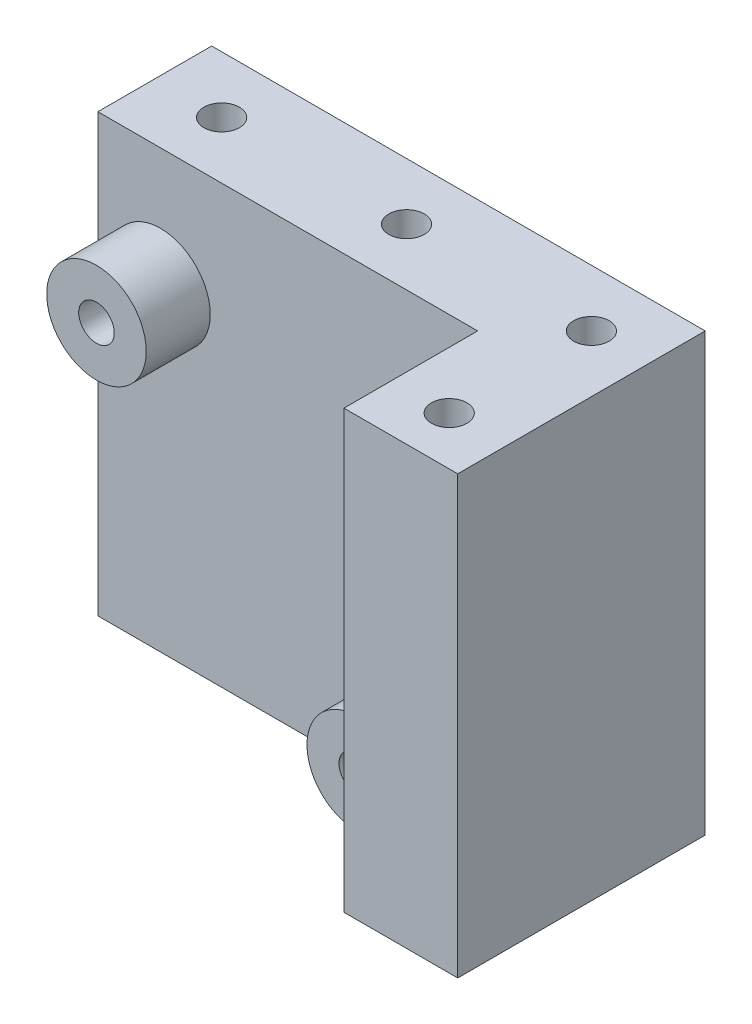
ISO-10303-21;
HEADER;
FILE_DESCRIPTION(('STEP AP214'),'2;1');
FILE_NAME('part.step','',(''),(''),'','','');
FILE_SCHEMA(('AUTOMOTIVE_DESIGN { 1 0 10303 214 1 1 1 1 }'));
ENDSEC;
DATA;
#1=APPLICATION_CONTEXT('core data for automotive mechanical design processes');
#2=APPLICATION_PROTOCOL_DEFINITION('international standard','automotive_design',2000,#1);
#3=PRODUCT_CONTEXT('',#1,'mechanical');
#4=PRODUCT('Part','Part','',(#3));
#5=PRODUCT_RELATED_PRODUCT_CATEGORY('part','',(#4));
#6=PRODUCT_DEFINITION_FORMATION('','',#4);
#7=PRODUCT_DEFINITION_CONTEXT('part definition',#1,'design');
#8=PRODUCT_DEFINITION('design','',#6,#7);
#9=PRODUCT_DEFINITION_SHAPE('','',#8);
#10=(LENGTH_UNIT() NAMED_UNIT(*) SI_UNIT(.MILLI.,.METRE.));
#11=(NAMED_UNIT(*) PLANE_ANGLE_UNIT() SI_UNIT($,.RADIAN.));
#12=(NAMED_UNIT(*) SI_UNIT($,.STERADIAN.) SOLID_ANGLE_UNIT());
#13=UNCERTAINTY_MEASURE_WITH_UNIT(LENGTH_MEASURE(1.E-05),#10,'distance_accuracy_value','');
#14=(GEOMETRIC_REPRESENTATION_CONTEXT(3) GLOBAL_UNCERTAINTY_ASSIGNED_CONTEXT((#13)) GLOBAL_UNIT_ASSIGNED_CONTEXT((#10,
#11,#12)) REPRESENTATION_CONTEXT('',''));
#15=CARTESIAN_POINT('',(0.,0.,0.));
#16=DIRECTION('',(0.,0.,1.));
#17=DIRECTION('',(1.,0.,0.));
#18=AXIS2_PLACEMENT_3D('',#15,#16,#17);
#19=CARTESIAN_POINT('',(0.,0.,8.));
#20=DIRECTION('',(0.,0.,1.));
#21=DIRECTION('',(1.,0.,0.));
#22=AXIS2_PLACEMENT_3D('',#19,#20,#21);
#23=PLANE('',#22);
#24=CARTESIAN_POINT('',(-12.,-11.35,8.));
#25=DIRECTION('',(0.,0.,1.));
#26=DIRECTION('',(1.,0.,0.));
#27=AXIS2_PLACEMENT_3D('',#24,#25,#26);
#28=CIRCLE('',#27,3.5);
#29=CARTESIAN_POINT('',(-8.5,-11.35,8.));
#30=VERTEX_POINT('',#29);
#31=EDGE_CURVE('E111',#30,#30,#28,.F.);
#32=ORIENTED_EDGE('',*,*,#31,.T.);
#33=EDGE_LOOP('',(#32));
#34=FACE_BOUND('',#33,.T.);
#35=CARTESIAN_POINT('',(-30.3,6.95,8.));
#36=DIRECTION('',(0.,0.,1.));
#37=DIRECTION('',(1.,0.,0.));
#38=AXIS2_PLACEMENT_3D('',#35,#36,#37);
#39=CIRCLE('',#38,3.5);
#40=CARTESIAN_POINT('',(-26.8,6.95,8.));
#41=VERTEX_POINT('',#40);
#42=EDGE_CURVE('E99',#41,#41,#39,.F.);
#43=ORIENTED_EDGE('',*,*,#42,.T.);
#44=EDGE_LOOP('',(#43));
#45=FACE_BOUND('',#44,.T.);
#46=DIRECTION('',(1.,0.,0.));
#47=VECTOR('',#46,1.);
#48=CARTESIAN_POINT('',(-34.7,-15.35,8.));
#49=LINE('',#48,#47);
#50=CARTESIAN_POINT('',(-34.7,-15.35,8.));
#51=VERTEX_POINT('',#50);
#52=CARTESIAN_POINT('',(-8.,-15.35,8.));
#53=VERTEX_POINT('',#52);
#54=EDGE_CURVE('E53',#51,#53,#49,.T.);
#55=ORIENTED_EDGE('',*,*,#54,.T.);
#56=DIRECTION('',(0.,-1.,0.));
#57=VECTOR('',#56,1.);
#58=CARTESIAN_POINT('',(-8.,15.35,8.));
#59=LINE('',#58,#57);
#60=CARTESIAN_POINT('',(-8.,15.35,8.));
#61=VERTEX_POINT('',#60);
#62=EDGE_CURVE('E145',#61,#53,#59,.T.);
#63=ORIENTED_EDGE('',*,*,#62,.F.);
#64=DIRECTION('',(-1.,0.,0.));
#65=VECTOR('',#64,1.);
#66=CARTESIAN_POINT('',(-34.7,15.35,8.));
#67=LINE('',#66,#65);
#68=CARTESIAN_POINT('',(-34.7,15.35,8.));
#69=VERTEX_POINT('',#68);
#70=EDGE_CURVE('E59',#61,#69,#67,.T.);
#71=ORIENTED_EDGE('',*,*,#70,.T.);
#72=DIRECTION('',(0.,-1.,0.));
#73=VECTOR('',#72,1.);
#74=CARTESIAN_POINT('',(-34.7,15.35,8.));
#75=LINE('',#74,#73);
#76=EDGE_CURVE('E89',#69,#51,#75,.T.);
#77=ORIENTED_EDGE('',*,*,#76,.T.);
#78=EDGE_LOOP('',(#55,#63,#71,#77));
#79=FACE_BOUND('',#78,.T.);
#80=ADVANCED_FACE('F32',(#34,#45,#79),#23,.T.);
#81=CARTESIAN_POINT('',(-34.7,15.35,8.));
#82=DIRECTION('',(1.,0.,0.));
#83=DIRECTION('',(0.,0.,-1.));
#84=AXIS2_PLACEMENT_3D('',#81,#82,#83);
#85=PLANE('',#84);
#86=DIRECTION('',(0.,-1.,0.));
#87=VECTOR('',#86,1.);
#88=CARTESIAN_POINT('',(-34.7,15.35,0.));
#89=LINE('',#88,#87);
#90=CARTESIAN_POINT('',(-34.7,15.35,0.));
#91=VERTEX_POINT('',#90);
#92=CARTESIAN_POINT('',(-34.7,-15.35,0.));
#93=VERTEX_POINT('',#92);
#94=EDGE_CURVE('E95',#91,#93,#89,.T.);
#95=ORIENTED_EDGE('',*,*,#94,.T.);
#96=DIRECTION('',(0.,0.,-1.));
#97=VECTOR('',#96,1.);
#98=CARTESIAN_POINT('',(-34.7,-15.35,8.));
#99=LINE('',#98,#97);
#100=EDGE_CURVE('E11',#51,#93,#99,.T.);
#101=ORIENTED_EDGE('',*,*,#100,.F.);
#102=ORIENTED_EDGE('',*,*,#76,.F.);
#103=DIRECTION('',(0.,0.,-1.));
#104=VECTOR('',#103,1.);
#105=CARTESIAN_POINT('',(-34.7,15.35,8.));
#106=LINE('',#105,#104);
#107=EDGE_CURVE('E81',#69,#91,#106,.T.);
#108=ORIENTED_EDGE('',*,*,#107,.T.);
#109=EDGE_LOOP('',(#95,#101,#102,#108));
#110=FACE_BOUND('',#109,.T.);
#111=ADVANCED_FACE('F34',(#110),#85,.F.);
#112=CARTESIAN_POINT('',(-34.7,-15.35,8.));
#113=DIRECTION('',(0.,1.,0.));
#114=DIRECTION('',(0.,0.,1.));
#115=AXIS2_PLACEMENT_3D('',#112,#113,#114);
#116=PLANE('',#115);
#117=CARTESIAN_POINT('',(-30.,-15.35,4.));
#118=DIRECTION('',(0.,1.,0.));
#119=DIRECTION('',(0.,0.,1.));
#120=AXIS2_PLACEMENT_3D('',#117,#118,#119);
#121=CIRCLE('',#120,1.25);
#122=CARTESIAN_POINT('',(-30.,-15.35,5.25));
#123=VERTEX_POINT('',#122);
#124=EDGE_CURVE('E180',#123,#123,#121,.T.);
#125=ORIENTED_EDGE('',*,*,#124,.T.);
#126=EDGE_LOOP('',(#125));
#127=FACE_BOUND('',#126,.T.);
#128=CARTESIAN_POINT('',(-17.,-15.35,4.));
#129=DIRECTION('',(0.,1.,0.));
#130=DIRECTION('',(0.,0.,1.));
#131=AXIS2_PLACEMENT_3D('',#128,#129,#130);
#132=CIRCLE('',#131,1.25);
#133=CARTESIAN_POINT('',(-17.,-15.35,5.25));
#134=VERTEX_POINT('',#133);
#135=EDGE_CURVE('E174',#134,#134,#132,.T.);
#136=ORIENTED_EDGE('',*,*,#135,.T.);
#137=EDGE_LOOP('',(#136));
#138=FACE_BOUND('',#137,.T.);
#139=CARTESIAN_POINT('',(-4.,-15.35,4.));
#140=DIRECTION('',(0.,1.,0.));
#141=DIRECTION('',(0.,0.,1.));
#142=AXIS2_PLACEMENT_3D('',#139,#140,#141);
#143=CIRCLE('',#142,1.25);
#144=CARTESIAN_POINT('',(-4.,-15.35,5.25));
#145=VERTEX_POINT('',#144);
#146=EDGE_CURVE('E169',#145,#145,#143,.T.);
#147=ORIENTED_EDGE('',*,*,#146,.T.);
#148=EDGE_LOOP('',(#147));
#149=FACE_BOUND('',#148,.T.);
#150=CARTESIAN_POINT('',(-4.,-15.35,14.));
#151=DIRECTION('',(0.,1.,0.));
#152=DIRECTION('',(0.,0.,1.));
#153=AXIS2_PLACEMENT_3D('',#150,#151,#152);
#154=CIRCLE('',#153,1.25);
#155=CARTESIAN_POINT('',(-4.,-15.35,15.25));
#156=VERTEX_POINT('',#155);
#157=EDGE_CURVE('E150',#156,#156,#154,.T.);
#158=ORIENTED_EDGE('',*,*,#157,.T.);
#159=EDGE_LOOP('',(#158));
#160=FACE_BOUND('',#159,.T.);
#161=DIRECTION('',(1.,0.,0.));
#162=VECTOR('',#161,1.);
#163=CARTESIAN_POINT('',(-34.7,-15.35,0.));
#164=LINE('',#163,#162);
#165=CARTESIAN_POINT('',(0.,-15.35,0.));
#166=VERTEX_POINT('',#165);
#167=EDGE_CURVE('E98',#93,#166,#164,.T.);
#168=ORIENTED_EDGE('',*,*,#167,.T.);
#169=DIRECTION('',(0.,0.,-1.));
#170=VECTOR('',#169,1.);
#171=CARTESIAN_POINT('',(0.,-15.35,8.));
#172=LINE('',#171,#170);
#173=CARTESIAN_POINT('',(0.,-15.35,17.4));
#174=VERTEX_POINT('',#173);
#175=EDGE_CURVE('E45',#174,#166,#172,.T.);
#176=ORIENTED_EDGE('',*,*,#175,.F.);
#177=DIRECTION('',(1.,0.,0.));
#178=VECTOR('',#177,1.);
#179=CARTESIAN_POINT('',(-8.,-15.35,17.4));
#180=LINE('',#179,#178);
#181=CARTESIAN_POINT('',(-8.,-15.35,17.4));
#182=VERTEX_POINT('',#181);
#183=EDGE_CURVE('E139',#182,#174,#180,.T.);
#184=ORIENTED_EDGE('',*,*,#183,.F.);
#185=DIRECTION('',(0.,0.,-1.));
#186=VECTOR('',#185,1.);
#187=CARTESIAN_POINT('',(-8.,-15.35,17.4));
#188=LINE('',#187,#186);
#189=EDGE_CURVE('E125',#182,#53,#188,.T.);
#190=ORIENTED_EDGE('',*,*,#189,.T.);
#191=ORIENTED_EDGE('',*,*,#54,.F.);
#192=ORIENTED_EDGE('',*,*,#100,.T.);
#193=EDGE_LOOP('',(#168,#176,#184,#190,#191,#192));
#194=FACE_BOUND('',#193,.T.);
#195=ADVANCED_FACE('F132',(#127,#138,#149,#160,#194),#116,.F.);
#196=CARTESIAN_POINT('',(0.,15.35,8.));
#197=DIRECTION('',(-1.,0.,0.));
#198=DIRECTION('',(0.,0.,1.));
#199=AXIS2_PLACEMENT_3D('',#196,#197,#198);
#200=PLANE('',#199);
#201=DIRECTION('',(0.,1.,0.));
#202=VECTOR('',#201,1.);
#203=CARTESIAN_POINT('',(0.,15.35,0.));
#204=LINE('',#203,#202);
#205=CARTESIAN_POINT('',(0.,15.35,0.));
#206=VERTEX_POINT('',#205);
#207=EDGE_CURVE('E90',#166,#206,#204,.T.);
#208=ORIENTED_EDGE('',*,*,#207,.T.);
#209=DIRECTION('',(0.,0.,-1.));
#210=VECTOR('',#209,1.);
#211=CARTESIAN_POINT('',(0.,15.35,8.));
#212=LINE('',#211,#210);
#213=CARTESIAN_POINT('',(0.,15.35,17.4));
#214=VERTEX_POINT('',#213);
#215=EDGE_CURVE('E85',#214,#206,#212,.T.);
#216=ORIENTED_EDGE('',*,*,#215,.F.);
#217=DIRECTION('',(0.,1.,0.));
#218=VECTOR('',#217,1.);
#219=CARTESIAN_POINT('',(0.,15.35,17.4));
#220=LINE('',#219,#218);
#221=EDGE_CURVE('E161',#174,#214,#220,.T.);
#222=ORIENTED_EDGE('',*,*,#221,.F.);
#223=ORIENTED_EDGE('',*,*,#175,.T.);
#224=EDGE_LOOP('',(#208,#216,#222,#223));
#225=FACE_BOUND('',#224,.T.);
#226=ADVANCED_FACE('F227',(#225),#200,.F.);
#227=CARTESIAN_POINT('',(-34.7,15.35,8.));
#228=DIRECTION('',(0.,-1.,0.));
#229=DIRECTION('',(0.,0.,-1.));
#230=AXIS2_PLACEMENT_3D('',#227,#228,#229);
#231=PLANE('',#230);
#232=CARTESIAN_POINT('',(-30.,15.35,4.));
#233=DIRECTION('',(0.,1.,0.));
#234=DIRECTION('',(0.,0.,1.));
#235=AXIS2_PLACEMENT_3D('',#232,#233,#234);
#236=CIRCLE('',#235,1.25);
#237=CARTESIAN_POINT('',(-30.,15.35,5.25));
#238=VERTEX_POINT('',#237);
#239=EDGE_CURVE('E183',#238,#238,#236,.T.);
#240=ORIENTED_EDGE('',*,*,#239,.F.);
#241=EDGE_LOOP('',(#240));
#242=FACE_BOUND('',#241,.T.);
#243=CARTESIAN_POINT('',(-17.,15.35,4.));
#244=DIRECTION('',(0.,1.,0.));
#245=DIRECTION('',(0.,0.,1.));
#246=AXIS2_PLACEMENT_3D('',#243,#244,#245);
#247=CIRCLE('',#246,1.25);
#248=CARTESIAN_POINT('',(-17.,15.35,5.25));
#249=VERTEX_POINT('',#248);
#250=EDGE_CURVE('E177',#249,#249,#247,.T.);
#251=ORIENTED_EDGE('',*,*,#250,.F.);
#252=EDGE_LOOP('',(#251));
#253=FACE_BOUND('',#252,.T.);
#254=CARTESIAN_POINT('',(-4.,15.35,4.));
#255=DIRECTION('',(0.,1.,0.));
#256=DIRECTION('',(0.,0.,1.));
#257=AXIS2_PLACEMENT_3D('',#254,#255,#256);
#258=CIRCLE('',#257,1.25);
#259=CARTESIAN_POINT('',(-4.,15.35,5.25));
#260=VERTEX_POINT('',#259);
#261=EDGE_CURVE('E171',#260,#260,#258,.T.);
#262=ORIENTED_EDGE('',*,*,#261,.F.);
#263=EDGE_LOOP('',(#262));
#264=FACE_BOUND('',#263,.T.);
#265=CARTESIAN_POINT('',(-4.,15.35,14.));
#266=DIRECTION('',(0.,1.,0.));
#267=DIRECTION('',(0.,0.,1.));
#268=AXIS2_PLACEMENT_3D('',#265,#266,#267);
#269=CIRCLE('',#268,1.25);
#270=CARTESIAN_POINT('',(-4.,15.35,15.25));
#271=VERTEX_POINT('',#270);
#272=EDGE_CURVE('E154',#271,#271,#269,.T.);
#273=ORIENTED_EDGE('',*,*,#272,.F.);
#274=EDGE_LOOP('',(#273));
#275=FACE_BOUND('',#274,.T.);
#276=DIRECTION('',(-1.,0.,0.));
#277=VECTOR('',#276,1.);
#278=CARTESIAN_POINT('',(-34.7,15.35,0.));
#279=LINE('',#278,#277);
#280=EDGE_CURVE('E78',#206,#91,#279,.T.);
#281=ORIENTED_EDGE('',*,*,#280,.T.);
#282=ORIENTED_EDGE('',*,*,#107,.F.);
#283=ORIENTED_EDGE('',*,*,#70,.F.);
#284=DIRECTION('',(0.,0.,-1.));
#285=VECTOR('',#284,1.);
#286=CARTESIAN_POINT('',(-8.,15.35,17.4));
#287=LINE('',#286,#285);
#288=CARTESIAN_POINT('',(-8.,15.35,17.4));
#289=VERTEX_POINT('',#288);
#290=EDGE_CURVE('E143',#289,#61,#287,.T.);
#291=ORIENTED_EDGE('',*,*,#290,.F.);
#292=DIRECTION('',(-1.,0.,0.));
#293=VECTOR('',#292,1.);
#294=CARTESIAN_POINT('',(-8.,15.35,17.4));
#295=LINE('',#294,#293);
#296=EDGE_CURVE('E158',#214,#289,#295,.T.);
#297=ORIENTED_EDGE('',*,*,#296,.F.);
#298=ORIENTED_EDGE('',*,*,#215,.T.);
#299=EDGE_LOOP('',(#281,#282,#283,#291,#297,#298));
#300=FACE_BOUND('',#299,.T.);
#301=ADVANCED_FACE('F80',(#242,#253,#264,#275,#300),#231,.F.);
#302=CARTESIAN_POINT('',(0.,0.,0.));
#303=DIRECTION('',(0.,0.,1.));
#304=DIRECTION('',(1.,0.,0.));
#305=AXIS2_PLACEMENT_3D('',#302,#303,#304);
#306=PLANE('',#305);
#307=CARTESIAN_POINT('',(-12.,-11.35,0.));
#308=DIRECTION('',(0.,0.,1.));
#309=DIRECTION('',(1.,0.,0.));
#310=AXIS2_PLACEMENT_3D('',#307,#308,#309);
#311=CIRCLE('',#310,1.25);
#312=CARTESIAN_POINT('',(-10.75,-11.35,0.));
#313=VERTEX_POINT('',#312);
#314=EDGE_CURVE('E191',#313,#313,#311,.T.);
#315=ORIENTED_EDGE('',*,*,#314,.T.);
#316=EDGE_LOOP('',(#315));
#317=FACE_BOUND('',#316,.T.);
#318=CARTESIAN_POINT('',(-30.3,6.95,0.));
#319=DIRECTION('',(0.,0.,1.));
#320=DIRECTION('',(1.,0.,0.));
#321=AXIS2_PLACEMENT_3D('',#318,#319,#320);
#322=CIRCLE('',#321,1.25);
#323=CARTESIAN_POINT('',(-29.05,6.95,0.));
#324=VERTEX_POINT('',#323);
#325=EDGE_CURVE('E188',#324,#324,#322,.T.);
#326=ORIENTED_EDGE('',*,*,#325,.T.);
#327=EDGE_LOOP('',(#326));
#328=FACE_BOUND('',#327,.T.);
#329=ORIENTED_EDGE('',*,*,#94,.F.);
#330=ORIENTED_EDGE('',*,*,#280,.F.);
#331=ORIENTED_EDGE('',*,*,#207,.F.);
#332=ORIENTED_EDGE('',*,*,#167,.F.);
#333=EDGE_LOOP('',(#329,#330,#331,#332));
#334=FACE_BOUND('',#333,.T.);
#335=ADVANCED_FACE('F97',(#317,#328,#334),#306,.F.);
#336=CARTESIAN_POINT('',(-30.3,6.95,12.5));
#337=DIRECTION('',(0.,0.,1.));
#338=DIRECTION('',(1.,0.,0.));
#339=AXIS2_PLACEMENT_3D('',#336,#337,#338);
#340=PLANE('',#339);
#341=CARTESIAN_POINT('',(-30.3,6.95,12.5));
#342=DIRECTION('',(0.,0.,1.));
#343=DIRECTION('',(1.,0.,0.));
#344=AXIS2_PLACEMENT_3D('',#341,#342,#343);
#345=CIRCLE('',#344,3.5);
#346=CARTESIAN_POINT('',(-26.8,6.95,12.5));
#347=VERTEX_POINT('',#346);
#348=EDGE_CURVE('E103',#347,#347,#345,.T.);
#349=ORIENTED_EDGE('',*,*,#348,.T.);
#350=EDGE_LOOP('',(#349));
#351=FACE_BOUND('',#350,.T.);
#352=CARTESIAN_POINT('',(-30.3,6.95,12.5));
#353=DIRECTION('',(0.,0.,1.));
#354=DIRECTION('',(1.,0.,0.));
#355=AXIS2_PLACEMENT_3D('',#352,#353,#354);
#356=CIRCLE('',#355,1.25);
#357=CARTESIAN_POINT('',(-29.05,6.95,12.5));
#358=VERTEX_POINT('',#357);
#359=EDGE_CURVE('E113',#358,#358,#356,.T.);
#360=ORIENTED_EDGE('',*,*,#359,.F.);
#361=EDGE_LOOP('',(#360));
#362=FACE_BOUND('',#361,.T.);
#363=ADVANCED_FACE('F224',(#351,#362),#340,.T.);
#364=CARTESIAN_POINT('',(-30.3,6.95,12.5));
#365=DIRECTION('',(0.,0.,-1.));
#366=DIRECTION('',(-1.,0.,0.));
#367=AXIS2_PLACEMENT_3D('',#364,#365,#366);
#368=CYLINDRICAL_SURFACE('',#367,3.5);
#369=ORIENTED_EDGE('',*,*,#42,.F.);
#370=EDGE_LOOP('',(#369));
#371=FACE_BOUND('',#370,.T.);
#372=ORIENTED_EDGE('',*,*,#348,.F.);
#373=EDGE_LOOP('',(#372));
#374=FACE_BOUND('',#373,.T.);
#375=ADVANCED_FACE('F220',(#371,#374),#368,.T.);
#376=CARTESIAN_POINT('',(-30.3,6.95,12.5));
#377=DIRECTION('',(0.,0.,-1.));
#378=DIRECTION('',(-1.,0.,0.));
#379=AXIS2_PLACEMENT_3D('',#376,#377,#378);
#380=CYLINDRICAL_SURFACE('',#379,1.25);
#381=ORIENTED_EDGE('',*,*,#359,.T.);
#382=EDGE_LOOP('',(#381));
#383=FACE_BOUND('',#382,.T.);
#384=ORIENTED_EDGE('',*,*,#325,.F.);
#385=EDGE_LOOP('',(#384));
#386=FACE_BOUND('',#385,.T.);
#387=CARTESIAN_POINT('',(-30.,5.73653389004884,5.25));
#388=CARTESIAN_POINT('',(-29.9412463632206,5.75106449995813,5.24999561357447));
#389=CARTESIAN_POINT('',(-29.883520507401,5.76989939462503,5.24582142390916));
#390=CARTESIAN_POINT('',(-29.7721884992692,5.81529724683818,5.23035784609344));
#391=CARTESIAN_POINT('',(-29.7185904915959,5.84187501163786,5.21905477616482));
#392=CARTESIAN_POINT('',(-29.6172694823372,5.90128697022694,5.19111497649041));
#393=CARTESIAN_POINT('',(-29.569497209412,5.93406168923682,5.17452799876263));
#394=CARTESIAN_POINT('',(-29.4798003621716,6.00498905595872,5.13764952349129));
#395=CARTESIAN_POINT('',(-29.4378759378679,6.04314184158072,5.11735793094621));
#396=CARTESIAN_POINT('',(-29.3543912447494,6.12996228308227,5.0715738510937));
#397=CARTESIAN_POINT('',(-29.3137655871467,6.17935241754986,5.04575388377298));
#398=CARTESIAN_POINT('',(-29.2404875214107,6.28366474843164,4.99380879493702));
#399=CARTESIAN_POINT('',(-29.2078428710078,6.33859225465381,4.96768340217708));
#400=CARTESIAN_POINT('',(-29.1545249601312,6.44647794014151,4.92128029158292));
#401=CARTESIAN_POINT('',(-29.132859028551,6.49880409142387,4.900681048242));
#402=CARTESIAN_POINT('',(-29.0965202737985,6.60737125451773,4.86422754105661));
#403=CARTESIAN_POINT('',(-29.0818303524493,6.66360230321417,4.84836171152458));
#404=CARTESIAN_POINT('',(-29.0625732600602,6.76714435630769,4.82698040868543));
#405=CARTESIAN_POINT('',(-29.0565328260862,6.81386605998472,4.81999541991254));
#406=CARTESIAN_POINT('',(-29.049808884926,6.90817788966768,4.81219889273503));
#407=CARTESIAN_POINT('',(-29.0491179680812,6.95576672293056,4.81137881530871));
#408=CARTESIAN_POINT('',(-29.0531342692516,7.05032809609308,4.81605887479332));
#409=CARTESIAN_POINT('',(-29.0578356327631,7.09730124849053,4.82155215717975));
#410=CARTESIAN_POINT('',(-29.0722780847509,7.18956020511032,4.83782280834825));
#411=CARTESIAN_POINT('',(-29.0820296774561,7.23484228069096,4.84861118821871));
#412=CARTESIAN_POINT('',(-29.1118766013458,7.34427472253959,4.87999822781733));
#413=CARTESIAN_POINT('',(-29.1346908278198,7.40703201584777,4.90281979996193));
#414=CARTESIAN_POINT('',(-29.189200215583,7.52705119641933,4.95208148754202));
#415=CARTESIAN_POINT('',(-29.2209165770479,7.5842995217652,4.97853016296684));
#416=CARTESIAN_POINT('',(-29.2941828221657,7.69526404328596,5.03270667626112));
#417=CARTESIAN_POINT('',(-29.3360691952169,7.74875408060377,5.06044404199208));
#418=CARTESIAN_POINT('',(-29.4287350129026,7.84890797315136,5.11309946388608));
#419=CARTESIAN_POINT('',(-29.4794983592326,7.89558390923856,5.13802249142409));
#420=CARTESIAN_POINT('',(-29.5791475674314,7.97276657308555,5.17800403108828));
#421=CARTESIAN_POINT('',(-29.6265607508403,8.0046607319097,5.19403700761521));
#422=CARTESIAN_POINT('',(-29.7264753382685,8.06215283005635,5.22079998568792));
#423=CARTESIAN_POINT('',(-29.7789739651622,8.08775417911707,5.23153286227082));
#424=CARTESIAN_POINT('',(-29.88838319448,8.1317667829695,5.24623808724419));
#425=CARTESIAN_POINT('',(-29.9453273467721,8.15011541624625,5.25015250892368));
#426=CARTESIAN_POINT('',(-30.0612386330728,8.17843066717673,5.24983887376638));
#427=CARTESIAN_POINT('',(-30.1202039391804,8.18840466087102,5.2456179929944));
#428=CARTESIAN_POINT('',(-30.2297823808945,8.19907466523275,5.22977506763477));
#429=CARTESIAN_POINT('',(-30.2804530144836,8.20083740450342,5.21922389415341));
#430=CARTESIAN_POINT('',(-30.3799535277386,8.19843269901149,5.19197149381307));
#431=CARTESIAN_POINT('',(-30.4287831986162,8.19426458367968,5.17526957168091));
#432=CARTESIAN_POINT('',(-30.5234768606539,8.1807935715374,5.13626688757029));
#433=CARTESIAN_POINT('',(-30.5693348721004,8.17148065997325,5.11395525214217));
#434=CARTESIAN_POINT('',(-30.65721920531,8.14873213877766,5.06447654579443));
#435=CARTESIAN_POINT('',(-30.6992440468968,8.13529494522642,5.03730761111828));
#436=CARTESIAN_POINT('',(-30.7968224982872,8.0986763565182,4.96575746963395));
#437=CARTESIAN_POINT('',(-30.850079935861,8.07381918257929,4.91909532689294));
#438=CARTESIAN_POINT('',(-30.9473832847756,8.0207381513532,4.81846793391864));
#439=CARTESIAN_POINT('',(-30.991400965879,7.99250437846181,4.76448110860662));
#440=CARTESIAN_POINT('',(-31.0706137824149,7.93542887691902,4.64905944878982));
#441=CARTESIAN_POINT('',(-31.1056423227085,7.90658510908416,4.58751149523157));
#442=CARTESIAN_POINT('',(-31.16525845911,7.85300909796885,4.4579595847582));
#443=CARTESIAN_POINT('',(-31.1898785486963,7.82826420801642,4.38997654287321));
#444=CARTESIAN_POINT('',(-31.2206870601933,7.79566666287827,4.27324026875429));
#445=CARTESIAN_POINT('',(-31.2303156584435,7.78493551697551,4.22621837433056));
#446=CARTESIAN_POINT('',(-31.2441063974024,7.76931414251734,4.13048253284484));
#447=CARTESIAN_POINT('',(-31.2482820752822,7.76440945221666,4.08177308534107));
#448=CARTESIAN_POINT('',(-31.2508584759678,7.76140270952525,3.98377481294021));
#449=CARTESIAN_POINT('',(-31.2492352883871,7.76332882225685,3.93448442639433));
#450=CARTESIAN_POINT('',(-31.2403048491597,7.7736311798107,3.83706439626301));
#451=CARTESIAN_POINT('',(-31.2329860592428,7.78202051762276,3.78893731361884));
#452=CARTESIAN_POINT('',(-31.2101071044815,7.80706946185049,3.68048064183924));
#453=CARTESIAN_POINT('',(-31.1927022522181,7.8254809913854,3.62096117149882));
#454=CARTESIAN_POINT('',(-31.1500894914341,7.8669131975846,3.50649833197098));
#455=CARTESIAN_POINT('',(-31.1248642068628,7.88994409729482,3.45156550220064));
#456=CARTESIAN_POINT('',(-31.06600421467,7.93856317145901,3.34423294268757));
#457=CARTESIAN_POINT('',(-31.0320661291503,7.96421758369616,3.29203051877763));
#458=CARTESIAN_POINT('',(-30.9566104076582,8.01462283205282,3.19298907265587));
#459=CARTESIAN_POINT('',(-30.9150987566562,8.03937436326646,3.14614586257928));
#460=CARTESIAN_POINT('',(-30.8264191871595,8.08479757770601,3.06022042489353));
#461=CARTESIAN_POINT('',(-30.7795467044999,8.10559349620824,3.02090147647139));
#462=CARTESIAN_POINT('',(-30.6792443118248,8.14227319698872,2.94884514141527));
#463=CARTESIAN_POINT('',(-30.6258213557311,8.15816212647764,2.91610087094415));
#464=CARTESIAN_POINT('',(-30.5229905113404,8.18087508297772,2.8634604165173));
#465=CARTESIAN_POINT('',(-30.4744614685613,8.18878543434911,2.84232430733498));
#466=CARTESIAN_POINT('',(-30.3745701021081,8.19878030063864,2.80626220274221));
#467=CARTESIAN_POINT('',(-30.3232098205326,8.2008689599451,2.79133179601739));
#468=CARTESIAN_POINT('',(-30.2189264624402,8.19846131324492,2.76815836330799));
#469=CARTESIAN_POINT('',(-30.1659981751128,8.19393987629472,2.75994104524311));
#470=CARTESIAN_POINT('',(-30.0605623710817,8.17801137217274,2.75034605557568));
#471=CARTESIAN_POINT('',(-30.0080548654776,8.16660412396744,2.74896856380647));
#472=CARTESIAN_POINT('',(-29.9082068511155,8.13808117342018,2.75243251920834));
#473=CARTESIAN_POINT('',(-29.8607441153129,8.12134092263161,2.75691275076176));
#474=CARTESIAN_POINT('',(-29.7687716065486,8.08260357965059,2.77069136608878));
#475=CARTESIAN_POINT('',(-29.7242632070782,8.06060406395871,2.77999197343374));
#476=CARTESIAN_POINT('',(-29.6241001282069,8.00358036576663,2.80637956228053));
#477=CARTESIAN_POINT('',(-29.5699274230111,7.96668449060474,2.82504789655957));
#478=CARTESIAN_POINT('',(-29.4690100950241,7.88602746456199,2.86706152072026));
#479=CARTESIAN_POINT('',(-29.4222780624727,7.84225492121493,2.8904145898301));
#480=CARTESIAN_POINT('',(-29.3358514519928,7.74816342679207,2.93984850970955));
#481=CARTESIAN_POINT('',(-29.2962804473862,7.69775153655341,2.96596679651078));
#482=CARTESIAN_POINT('',(-29.2252244328673,7.59144176798903,3.01808375459643));
#483=CARTESIAN_POINT('',(-29.1937397675716,7.53554365599652,3.0440824207366));
#484=CARTESIAN_POINT('',(-29.1435621556699,7.42761245587623,3.08897682070776));
#485=CARTESIAN_POINT('',(-29.1236362224213,7.37635394927128,3.10834659663047));
#486=CARTESIAN_POINT('',(-29.0904408622063,7.2702194957852,3.14223083526608));
#487=CARTESIAN_POINT('',(-29.0771557989307,7.21535239386346,3.15675667617337));
#488=CARTESIAN_POINT('',(-29.0598467653856,7.11331771798567,3.1761362514819));
#489=CARTESIAN_POINT('',(-29.0545581118785,7.06662132058076,3.18228817121412));
#490=CARTESIAN_POINT('',(-29.0493185242168,6.97254823248979,3.18838184939248));
#491=CARTESIAN_POINT('',(-29.0493615904257,6.92517236643962,3.18833058810788));
#492=CARTESIAN_POINT('',(-29.0547636165177,6.83126924076817,3.18205019759298));
#493=CARTESIAN_POINT('',(-29.0601113444219,6.78474039964879,3.17583412161697));
#494=CARTESIAN_POINT('',(-29.0757285498162,6.69345988203538,3.15836064117144));
#495=CARTESIAN_POINT('',(-29.0860079419579,6.64871198307986,3.14709308417362));
#496=CARTESIAN_POINT('',(-29.1174790669516,6.53905353311024,3.11433798498925));
#497=CARTESIAN_POINT('',(-29.1415647467811,6.47566466196858,3.09057759355768));
#498=CARTESIAN_POINT('',(-29.1988705308518,6.3545842754881,3.03970452351781));
#499=CARTESIAN_POINT('',(-29.2321128631008,6.29690709465982,3.01258377685295));
#500=CARTESIAN_POINT('',(-29.3087062194797,6.18542592483253,2.95744223980064));
#501=CARTESIAN_POINT('',(-29.3523868932957,6.13184541609657,2.92942544132185));
#502=CARTESIAN_POINT('',(-29.4489104236897,6.03187444563196,2.87669400090427));
#503=CARTESIAN_POINT('',(-29.5017344993525,5.98546960765319,2.85197277046843));
#504=CARTESIAN_POINT('',(-29.6037708313139,5.91035422082765,2.81349238037978));
#505=CARTESIAN_POINT('',(-29.6512989328072,5.87998673875622,2.79851881087989));
#506=CARTESIAN_POINT('',(-29.7511332693554,5.82551300424052,2.77394895774167));
#507=CARTESIAN_POINT('',(-29.8034365889714,5.80140296550771,2.7643494182674));
#508=CARTESIAN_POINT('',(-29.912060561509,5.7602953333522,2.75189168760461));
#509=CARTESIAN_POINT('',(-29.9684095976494,5.74335522297867,2.74908715901175));
#510=CARTESIAN_POINT('',(-30.0827769267115,5.71762780715564,2.75143690432886));
#511=CARTESIAN_POINT('',(-30.1407939850688,5.70883462427071,2.75658543350323));
#512=CARTESIAN_POINT('',(-30.2489268942037,5.70001453598355,2.77396753003713));
#513=CARTESIAN_POINT('',(-30.2991256183556,5.69903097373872,2.78523723149482));
#514=CARTESIAN_POINT('',(-30.3975400434488,5.70283857520206,2.81379276541209));
#515=CARTESIAN_POINT('',(-30.4457554615613,5.70763055959852,2.83107945261949));
#516=CARTESIAN_POINT('',(-30.5397260239014,5.72226730537212,2.87135077653614));
#517=CARTESIAN_POINT('',(-30.5854361537005,5.73218330689796,2.89441332228998));
#518=CARTESIAN_POINT('',(-30.6729097739916,5.75605786543138,2.94536318711949));
#519=CARTESIAN_POINT('',(-30.7146717748203,5.77001794029254,2.97325231616138));
#520=CARTESIAN_POINT('',(-30.81179482939,5.80790829132196,3.04674655095487));
#521=CARTESIAN_POINT('',(-30.8647690508499,5.83349283910652,3.09466096429622));
#522=CARTESIAN_POINT('',(-30.961294243441,5.88779908904577,3.19785756544629));
#523=CARTESIAN_POINT('',(-31.0048139202934,5.91653074991623,3.25316327128582));
#524=CARTESIAN_POINT('',(-31.0827725116894,5.97421890487733,3.37134238762347));
#525=CARTESIAN_POINT('',(-31.1170421356772,6.00317074975771,3.43432972231699));
#526=CARTESIAN_POINT('',(-31.1747719768419,6.05624101995381,3.56687685059099));
#527=CARTESIAN_POINT('',(-31.1982735916868,6.08037775131662,3.63641021282423));
#528=CARTESIAN_POINT('',(-31.2265759993346,6.11082028548284,3.75460385881347));
#529=CARTESIAN_POINT('',(-31.2350769268378,6.12041921049609,3.80150894723378));
#530=CARTESIAN_POINT('',(-31.2466484467122,6.13364348825329,3.89676400327166));
#531=CARTESIAN_POINT('',(-31.249731388924,6.13728242499515,3.94511042877411));
#532=CARTESIAN_POINT('',(-31.2502353717999,6.13787102500135,4.04199741259563));
#533=CARTESIAN_POINT('',(-31.2476422245289,6.13480392590129,4.09053815396464));
#534=CARTESIAN_POINT('',(-31.2369851630083,6.12258242827542,4.18627728025744));
#535=CARTESIAN_POINT('',(-31.2289093702232,6.11341481341152,4.23347251823707));
#536=CARTESIAN_POINT('',(-31.2039690046209,6.08641318709855,4.3421984404153));
#537=CARTESIAN_POINT('',(-31.184982890947,6.06664448391086,4.40274542000586));
#538=CARTESIAN_POINT('',(-31.1388969731864,6.02276494618409,4.5189825491743));
#539=CARTESIAN_POINT('',(-31.1117790203763,5.9986444477364,4.57466147136965));
#540=CARTESIAN_POINT('',(-31.0486837895407,5.94816358580338,4.68327602658935));
#541=CARTESIAN_POINT('',(-31.0123834142794,5.92175173488419,4.73599952718607));
#542=CARTESIAN_POINT('',(-30.931796388301,5.87036291299578,4.83567630053052));
#543=CARTESIAN_POINT('',(-30.8875179680759,5.84538449792359,4.88263543687994));
#544=CARTESIAN_POINT('',(-30.7955065851567,5.80137757969255,4.96600297223705));
#545=CARTESIAN_POINT('',(-30.7484563956403,5.78201426930843,5.00298292141696));
#546=CARTESIAN_POINT('',(-30.6482602810058,5.74833542831795,5.0704640994619));
#547=CARTESIAN_POINT('',(-30.5951204686494,5.73401489359314,5.10097173899867));
#548=CARTESIAN_POINT('',(-30.4925696641104,5.71399854420539,5.15003352130838));
#549=CARTESIAN_POINT('',(-30.4438972065734,5.70729717476153,5.16971491939864));
#550=CARTESIAN_POINT('',(-30.3440585009274,5.69977830198743,5.20286296691329));
#551=CARTESIAN_POINT('',(-30.2928954528899,5.69895343908129,5.21633737000927));
#552=CARTESIAN_POINT('',(-30.2011088580894,5.70326849823953,5.23439608572653));
#553=CARTESIAN_POINT('',(-30.1606755859754,5.70712098325793,5.24029194876068));
#554=CARTESIAN_POINT('',(-30.0800045752701,5.7188359180943,5.24809569394839));
#555=CARTESIAN_POINT('',(-30.03976686738,5.72669897822232,5.25000296891243));
#556=CARTESIAN_POINT('',(-30.,5.73653389004884,5.25));
#557=B_SPLINE_CURVE_WITH_KNOTS('',3,(#387,#388,#389,#390,#391,#392,#393,#394,#395,#396,#397,
#398,#399,#400,#401,#402,#403,#404,#405,#406,#407,#408,#409,#410,#411,#412,#413,#414,#415,#416,
#417,#418,#419,#420,#421,#422,#423,#424,#425,#426,#427,#428,#429,#430,#431,#432,#433,#434,#435,
#436,#437,#438,#439,#440,#441,#442,#443,#444,#445,#446,#447,#448,#449,#450,#451,#452,#453,#454,
#455,#456,#457,#458,#459,#460,#461,#462,#463,#464,#465,#466,#467,#468,#469,#470,#471,#472,#473,
#474,#475,#476,#477,#478,#479,#480,#481,#482,#483,#484,#485,#486,#487,#488,#489,#490,#491,#492,
#493,#494,#495,#496,#497,#498,#499,#500,#501,#502,#503,#504,#505,#506,#507,#508,#509,#510,#511,
#512,#513,#514,#515,#516,#517,#518,#519,#520,#521,#522,#523,#524,#525,#526,#527,#528,#529,#530,
#531,#532,#533,#534,#535,#536,#537,#538,#539,#540,#541,#542,#543,#544,#545,#546,#547,#548,#549,
#550,#551,#552,#553,#554,#555,#556),.UNSPECIFIED.,.T.,.F.,(4,2,2,2,2,2,2,2,2,2,2,2,2,2,2,2,2,2,
2,2,2,2,2,2,2,2,2,2,2,2,2,2,2,2,2,2,2,2,2,2,2,2,2,2,2,2,2,2,2,2,2,2,2,2,2,2,2,2,2,2,2,2,2,2,2,2,
2,2,2,2,2,2,2,2,2,2,2,2,2,2,2,2,2,2,4),(0.,0.181378329680283,0.3631058251416,0.543170425151396,
0.723239643405011,0.929423896963143,1.1358077767689,1.31604633417136,1.49584081784203,
1.63809080341232,1.7801437220914,1.92204255702862,2.0642377270419,2.27478391498512,
2.48583583005744,2.70515385588569,2.92407819902048,3.10144662130413,3.2787187241785,
3.45748964183786,3.63610293971613,3.79071246434351,3.9453394712112,4.10026853783646,
4.25525717917566,4.47918007613657,4.70377747493108,4.93227757641247,5.16005897404448,
5.30705367314327,5.4536827517809,5.60091712072408,5.74845053904939,5.94144930042602,
6.13487999266647,6.33627172256868,6.53750498767886,6.73062699646491,6.92354573544679,
7.08343100088905,7.24320241694401,7.403582850286,7.5639675003424,7.71491346715753,
7.86592912527144,8.06927463447134,8.27296064621526,8.4798820025768,8.68681217587109,
8.86120058082884,9.03517642109441,9.17672298329243,9.31811026851382,9.45919882092843,
9.60057221495902,9.81495515816599,10.0298631789049,10.2527547589676,10.4751938290161,
10.6495889816225,10.8238783629183,10.9995397460261,11.1750743028929,11.3287133759365,
11.4823742832176,11.6382314583783,11.7941472070456,12.0205463000595,12.2476837204973,
12.4787327695422,12.7088859382372,12.8541910549182,12.9991645291436,13.1445007923269,
13.2901529458418,13.4884464883226,13.6871859204978,13.8942374552576,14.1010765972448,
14.289062131859,14.4768605928056,14.6349710031845,14.7928833655491,14.9156289622514,
15.0383932433643),.UNSPECIFIED.);
#558=CARTESIAN_POINT('',(-30.,5.73653389004884,5.25));
#559=VERTEX_POINT('',#558);
#560=EDGE_CURVE('E36',#559,#559,#557,.T.);
#561=ORIENTED_EDGE('',*,*,#560,.F.);
#562=EDGE_LOOP('',(#561));
#563=FACE_BOUND('',#562,.T.);
#564=ADVANCED_FACE('F280',(#383,#386,#563),#380,.F.);
#565=CARTESIAN_POINT('',(-12.,-11.35,12.5));
#566=DIRECTION('',(0.,0.,1.));
#567=DIRECTION('',(1.,0.,0.));
#568=AXIS2_PLACEMENT_3D('',#565,#566,#567);
#569=PLANE('',#568);
#570=CARTESIAN_POINT('',(-12.,-11.35,12.5));
#571=DIRECTION('',(0.,0.,1.));
#572=DIRECTION('',(1.,0.,0.));
#573=AXIS2_PLACEMENT_3D('',#570,#571,#572);
#574=CIRCLE('',#573,3.5);
#575=CARTESIAN_POINT('',(-8.5,-11.35,12.5));
#576=VERTEX_POINT('',#575);
#577=EDGE_CURVE('E114',#576,#576,#574,.T.);
#578=ORIENTED_EDGE('',*,*,#577,.T.);
#579=EDGE_LOOP('',(#578));
#580=FACE_BOUND('',#579,.T.);
#581=CARTESIAN_POINT('',(-12.,-11.35,12.5));
#582=DIRECTION('',(0.,0.,1.));
#583=DIRECTION('',(1.,0.,0.));
#584=AXIS2_PLACEMENT_3D('',#581,#582,#583);
#585=CIRCLE('',#584,1.25);
#586=CARTESIAN_POINT('',(-10.75,-11.35,12.5));
#587=VERTEX_POINT('',#586);
#588=EDGE_CURVE('E120',#587,#587,#585,.T.);
#589=ORIENTED_EDGE('',*,*,#588,.F.);
#590=EDGE_LOOP('',(#589));
#591=FACE_BOUND('',#590,.T.);
#592=ADVANCED_FACE('F208',(#580,#591),#569,.T.);
#593=CARTESIAN_POINT('',(-12.,-11.35,12.5));
#594=DIRECTION('',(0.,0.,-1.));
#595=DIRECTION('',(-1.,0.,0.));
#596=AXIS2_PLACEMENT_3D('',#593,#594,#595);
#597=CYLINDRICAL_SURFACE('',#596,3.5);
#598=ORIENTED_EDGE('',*,*,#31,.F.);
#599=EDGE_LOOP('',(#598));
#600=FACE_BOUND('',#599,.T.);
#601=ORIENTED_EDGE('',*,*,#577,.F.);
#602=EDGE_LOOP('',(#601));
#603=FACE_BOUND('',#602,.T.);
#604=ADVANCED_FACE('F199',(#600,#603),#597,.T.);
#605=CARTESIAN_POINT('',(-12.,-11.35,12.5));
#606=DIRECTION('',(0.,0.,-1.));
#607=DIRECTION('',(-1.,0.,0.));
#608=AXIS2_PLACEMENT_3D('',#605,#606,#607);
#609=CYLINDRICAL_SURFACE('',#608,1.25);
#610=ORIENTED_EDGE('',*,*,#588,.T.);
#611=EDGE_LOOP('',(#610));
#612=FACE_BOUND('',#611,.T.);
#613=ORIENTED_EDGE('',*,*,#314,.F.);
#614=EDGE_LOOP('',(#613));
#615=FACE_BOUND('',#614,.T.);
#616=ADVANCED_FACE('F197',(#612,#615),#609,.F.);
#617=CARTESIAN_POINT('',(-8.,15.35,17.4));
#618=DIRECTION('',(1.,0.,0.));
#619=DIRECTION('',(0.,1.,0.));
#620=AXIS2_PLACEMENT_3D('',#617,#618,#619);
#621=PLANE('',#620);
#622=ORIENTED_EDGE('',*,*,#62,.T.);
#623=ORIENTED_EDGE('',*,*,#189,.F.);
#624=DIRECTION('',(0.,-1.,0.));
#625=VECTOR('',#624,1.);
#626=CARTESIAN_POINT('',(-8.,15.35,17.4));
#627=LINE('',#626,#625);
#628=EDGE_CURVE('E149',#289,#182,#627,.T.);
#629=ORIENTED_EDGE('',*,*,#628,.F.);
#630=ORIENTED_EDGE('',*,*,#290,.T.);
#631=EDGE_LOOP('',(#622,#623,#629,#630));
#632=FACE_BOUND('',#631,.T.);
#633=ADVANCED_FACE('F146',(#632),#621,.F.);
#634=CARTESIAN_POINT('',(0.,0.,17.4));
#635=DIRECTION('',(0.,0.,1.));
#636=DIRECTION('',(1.,0.,0.));
#637=AXIS2_PLACEMENT_3D('',#634,#635,#636);
#638=PLANE('',#637);
#639=ORIENTED_EDGE('',*,*,#628,.T.);
#640=ORIENTED_EDGE('',*,*,#183,.T.);
#641=ORIENTED_EDGE('',*,*,#221,.T.);
#642=ORIENTED_EDGE('',*,*,#296,.T.);
#643=EDGE_LOOP('',(#639,#640,#641,#642));
#644=FACE_BOUND('',#643,.T.);
#645=ADVANCED_FACE('F206',(#644),#638,.T.);
#646=CARTESIAN_POINT('',(-4.,-15.35,14.));
#647=DIRECTION('',(0.,1.,0.));
#648=DIRECTION('',(0.,0.,1.));
#649=AXIS2_PLACEMENT_3D('',#646,#647,#648);
#650=CYLINDRICAL_SURFACE('',#649,1.25);
#651=ORIENTED_EDGE('',*,*,#157,.F.);
#652=EDGE_LOOP('',(#651));
#653=FACE_BOUND('',#652,.T.);
#654=ORIENTED_EDGE('',*,*,#272,.T.);
#655=EDGE_LOOP('',(#654));
#656=FACE_BOUND('',#655,.T.);
#657=ADVANCED_FACE('F243',(#653,#656),#650,.F.);
#658=CARTESIAN_POINT('',(-4.,-15.35,4.));
#659=DIRECTION('',(0.,1.,0.));
#660=DIRECTION('',(0.,0.,1.));
#661=AXIS2_PLACEMENT_3D('',#658,#659,#660);
#662=CYLINDRICAL_SURFACE('',#661,1.25);
#663=ORIENTED_EDGE('',*,*,#146,.F.);
#664=EDGE_LOOP('',(#663));
#665=FACE_BOUND('',#664,.T.);
#666=ORIENTED_EDGE('',*,*,#261,.T.);
#667=EDGE_LOOP('',(#666));
#668=FACE_BOUND('',#667,.T.);
#669=ADVANCED_FACE('F246',(#665,#668),#662,.F.);
#670=CARTESIAN_POINT('',(-17.,-15.35,4.));
#671=DIRECTION('',(0.,1.,0.));
#672=DIRECTION('',(0.,0.,1.));
#673=AXIS2_PLACEMENT_3D('',#670,#671,#672);
#674=CYLINDRICAL_SURFACE('',#673,1.25);
#675=ORIENTED_EDGE('',*,*,#135,.F.);
#676=EDGE_LOOP('',(#675));
#677=FACE_BOUND('',#676,.T.);
#678=ORIENTED_EDGE('',*,*,#250,.T.);
#679=EDGE_LOOP('',(#678));
#680=FACE_BOUND('',#679,.T.);
#681=ADVANCED_FACE('F254',(#677,#680),#674,.F.);
#682=CARTESIAN_POINT('',(-30.,-15.35,4.));
#683=DIRECTION('',(0.,1.,0.));
#684=DIRECTION('',(0.,0.,1.));
#685=AXIS2_PLACEMENT_3D('',#682,#683,#684);
#686=CYLINDRICAL_SURFACE('',#685,1.25);
#687=ORIENTED_EDGE('',*,*,#560,.T.);
#688=EDGE_LOOP('',(#687));
#689=FACE_BOUND('',#688,.T.);
#690=ORIENTED_EDGE('',*,*,#124,.F.);
#691=EDGE_LOOP('',(#690));
#692=FACE_BOUND('',#691,.T.);
#693=ORIENTED_EDGE('',*,*,#239,.T.);
#694=EDGE_LOOP('',(#693));
#695=FACE_BOUND('',#694,.T.);
#696=ADVANCED_FACE('F260',(#689,#692,#695),#686,.F.);
#697=CLOSED_SHELL('',(#80,#111,#195,#226,#301,#335,#363,#375,#564,#592,#604,#616,#633,#645,#657,
#669,#681,#696));
#698=MANIFOLD_SOLID_BREP('B2',#697);
#699=ADVANCED_BREP_SHAPE_REPRESENTATION('',(#18,#698),#14);
#700=SHAPE_DEFINITION_REPRESENTATION(#9,#699);
ENDSEC;
END-ISO-10303-21;
